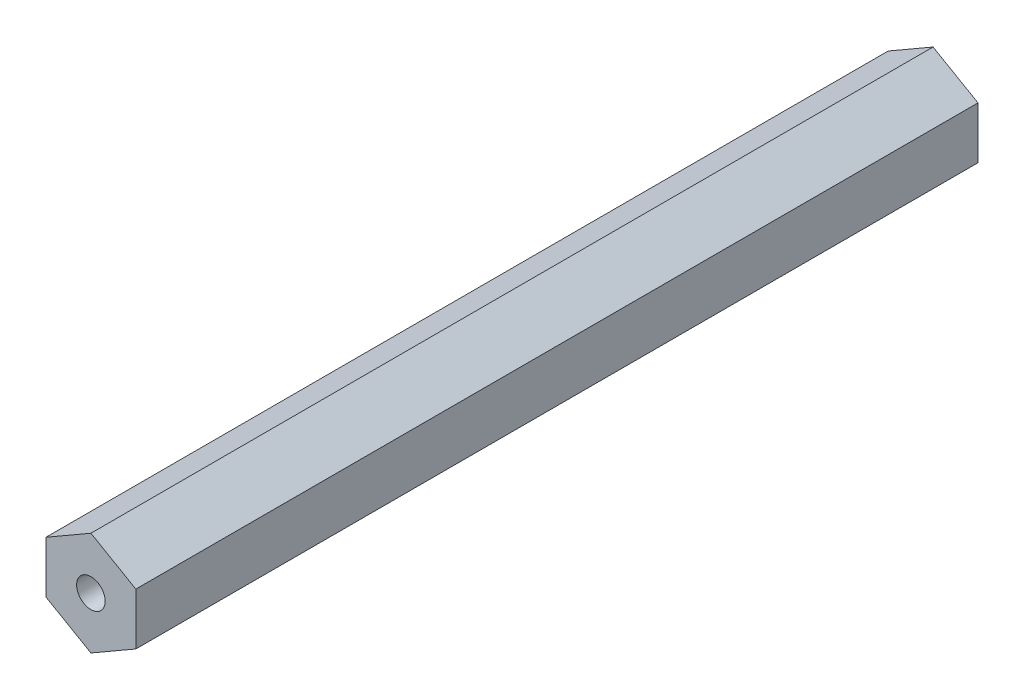
ISO-10303-21;
HEADER;
FILE_DESCRIPTION(('STEP AP214'),'2;1');
FILE_NAME('part.step','',(''),(''),'','','');
FILE_SCHEMA(('AUTOMOTIVE_DESIGN { 1 0 10303 214 1 1 1 1 }'));
ENDSEC;
DATA;
#1=APPLICATION_CONTEXT('core data for automotive mechanical design processes');
#2=APPLICATION_PROTOCOL_DEFINITION('international standard','automotive_design',2000,#1);
#3=PRODUCT_CONTEXT('',#1,'mechanical');
#4=PRODUCT('Part','Part','',(#3));
#5=PRODUCT_RELATED_PRODUCT_CATEGORY('part','',(#4));
#6=PRODUCT_DEFINITION_FORMATION('','',#4);
#7=PRODUCT_DEFINITION_CONTEXT('part definition',#1,'design');
#8=PRODUCT_DEFINITION('design','',#6,#7);
#9=PRODUCT_DEFINITION_SHAPE('','',#8);
#10=(LENGTH_UNIT() NAMED_UNIT(*) SI_UNIT(.MILLI.,.METRE.));
#11=(NAMED_UNIT(*) PLANE_ANGLE_UNIT() SI_UNIT($,.RADIAN.));
#12=(NAMED_UNIT(*) SI_UNIT($,.STERADIAN.) SOLID_ANGLE_UNIT());
#13=UNCERTAINTY_MEASURE_WITH_UNIT(LENGTH_MEASURE(1.E-05),#10,'distance_accuracy_value','');
#14=(GEOMETRIC_REPRESENTATION_CONTEXT(3) GLOBAL_UNCERTAINTY_ASSIGNED_CONTEXT((#13)) GLOBAL_UNIT_ASSIGNED_CONTEXT((#10,
#11,#12)) REPRESENTATION_CONTEXT('',''));
#15=CARTESIAN_POINT('',(0.,0.,0.));
#16=DIRECTION('',(0.,0.,1.));
#17=DIRECTION('',(1.,0.,0.));
#18=AXIS2_PLACEMENT_3D('',#15,#16,#17);
#19=CARTESIAN_POINT('',(6.35,3.66617420935412,119.0625));
#20=DIRECTION('',(-0.5,-0.866025403784439,0.));
#21=DIRECTION('',(0.866025403784439,-0.5,0.));
#22=AXIS2_PLACEMENT_3D('',#19,#20,#21);
#23=PLANE('',#22);
#24=DIRECTION('',(-0.866025403784439,0.5,0.));
#25=VECTOR('',#24,1.);
#26=CARTESIAN_POINT('',(6.35,3.66617420935412,0.));
#27=LINE('',#26,#25);
#28=CARTESIAN_POINT('',(6.35,3.66617420935412,0.));
#29=VERTEX_POINT('',#28);
#30=CARTESIAN_POINT('',(0.,7.33234841870825,0.));
#31=VERTEX_POINT('',#30);
#32=EDGE_CURVE('E137',#29,#31,#27,.T.);
#33=ORIENTED_EDGE('',*,*,#32,.T.);
#34=DIRECTION('',(0.,0.,-1.));
#35=VECTOR('',#34,1.);
#36=CARTESIAN_POINT('',(0.,7.33234841870825,119.0625));
#37=LINE('',#36,#35);
#38=CARTESIAN_POINT('',(0.,7.33234841870825,119.0625));
#39=VERTEX_POINT('',#38);
#40=EDGE_CURVE('E11',#39,#31,#37,.T.);
#41=ORIENTED_EDGE('',*,*,#40,.F.);
#42=DIRECTION('',(-0.866025403784439,0.5,0.));
#43=VECTOR('',#42,1.);
#44=CARTESIAN_POINT('',(6.35,3.66617420935412,119.0625));
#45=LINE('',#44,#43);
#46=CARTESIAN_POINT('',(6.35,3.66617420935412,119.0625));
#47=VERTEX_POINT('',#46);
#48=EDGE_CURVE('E154',#47,#39,#45,.T.);
#49=ORIENTED_EDGE('',*,*,#48,.F.);
#50=DIRECTION('',(0.,0.,-1.));
#51=VECTOR('',#50,1.);
#52=CARTESIAN_POINT('',(6.35,3.66617420935412,119.0625));
#53=LINE('',#52,#51);
#54=EDGE_CURVE('E133',#47,#29,#53,.T.);
#55=ORIENTED_EDGE('',*,*,#54,.T.);
#56=EDGE_LOOP('',(#33,#41,#49,#55));
#57=FACE_BOUND('',#56,.T.);
#58=ADVANCED_FACE('F44',(#57),#23,.F.);
#59=CARTESIAN_POINT('',(0.,7.33234841870825,119.0625));
#60=DIRECTION('',(0.5,-0.866025403784439,0.));
#61=DIRECTION('',(0.866025403784439,0.5,0.));
#62=AXIS2_PLACEMENT_3D('',#59,#60,#61);
#63=PLANE('',#62);
#64=DIRECTION('',(-0.866025403784439,-0.5,0.));
#65=VECTOR('',#64,1.);
#66=CARTESIAN_POINT('',(0.,7.33234841870825,0.));
#67=LINE('',#66,#65);
#68=CARTESIAN_POINT('',(-6.35,3.66617420935413,0.));
#69=VERTEX_POINT('',#68);
#70=EDGE_CURVE('E141',#31,#69,#67,.T.);
#71=ORIENTED_EDGE('',*,*,#70,.T.);
#72=DIRECTION('',(0.,0.,-1.));
#73=VECTOR('',#72,1.);
#74=CARTESIAN_POINT('',(-6.35,3.66617420935413,119.0625));
#75=LINE('',#74,#73);
#76=CARTESIAN_POINT('',(-6.35,3.66617420935413,119.0625));
#77=VERTEX_POINT('',#76);
#78=EDGE_CURVE('E53',#77,#69,#75,.T.);
#79=ORIENTED_EDGE('',*,*,#78,.F.);
#80=DIRECTION('',(-0.866025403784439,-0.5,0.));
#81=VECTOR('',#80,1.);
#82=CARTESIAN_POINT('',(0.,7.33234841870825,119.0625));
#83=LINE('',#82,#81);
#84=EDGE_CURVE('E99',#39,#77,#83,.T.);
#85=ORIENTED_EDGE('',*,*,#84,.F.);
#86=ORIENTED_EDGE('',*,*,#40,.T.);
#87=EDGE_LOOP('',(#71,#79,#85,#86));
#88=FACE_BOUND('',#87,.T.);
#89=ADVANCED_FACE('F184',(#88),#63,.F.);
#90=CARTESIAN_POINT('',(-6.35,3.66617420935413,119.0625));
#91=DIRECTION('',(1.,0.,0.));
#92=DIRECTION('',(0.,1.,0.));
#93=AXIS2_PLACEMENT_3D('',#90,#91,#92);
#94=PLANE('',#93);
#95=DIRECTION('',(0.,-1.,0.));
#96=VECTOR('',#95,1.);
#97=CARTESIAN_POINT('',(-6.35,3.66617420935413,0.));
#98=LINE('',#97,#96);
#99=CARTESIAN_POINT('',(-6.35,-3.66617420935412,0.));
#100=VERTEX_POINT('',#99);
#101=EDGE_CURVE('E145',#69,#100,#98,.T.);
#102=ORIENTED_EDGE('',*,*,#101,.T.);
#103=DIRECTION('',(0.,0.,-1.));
#104=VECTOR('',#103,1.);
#105=CARTESIAN_POINT('',(-6.35,-3.66617420935412,119.0625));
#106=LINE('',#105,#104);
#107=CARTESIAN_POINT('',(-6.35,-3.66617420935412,119.0625));
#108=VERTEX_POINT('',#107);
#109=EDGE_CURVE('E125',#108,#100,#106,.T.);
#110=ORIENTED_EDGE('',*,*,#109,.F.);
#111=DIRECTION('',(0.,-1.,0.));
#112=VECTOR('',#111,1.);
#113=CARTESIAN_POINT('',(-6.35,3.66617420935413,119.0625));
#114=LINE('',#113,#112);
#115=EDGE_CURVE('E114',#77,#108,#114,.T.);
#116=ORIENTED_EDGE('',*,*,#115,.F.);
#117=ORIENTED_EDGE('',*,*,#78,.T.);
#118=EDGE_LOOP('',(#102,#110,#116,#117));
#119=FACE_BOUND('',#118,.T.);
#120=ADVANCED_FACE('F165',(#119),#94,.F.);
#121=CARTESIAN_POINT('',(-6.35,-3.66617420935412,119.0625));
#122=DIRECTION('',(0.5,0.866025403784439,0.));
#123=DIRECTION('',(-0.866025403784439,0.5,0.));
#124=AXIS2_PLACEMENT_3D('',#121,#122,#123);
#125=PLANE('',#124);
#126=DIRECTION('',(0.866025403784438,-0.5,0.));
#127=VECTOR('',#126,1.);
#128=CARTESIAN_POINT('',(-6.35,-3.66617420935412,0.));
#129=LINE('',#128,#127);
#130=CARTESIAN_POINT('',(0.,-7.33234841870825,0.));
#131=VERTEX_POINT('',#130);
#132=EDGE_CURVE('E123',#100,#131,#129,.T.);
#133=ORIENTED_EDGE('',*,*,#132,.T.);
#134=DIRECTION('',(0.,0.,-1.));
#135=VECTOR('',#134,1.);
#136=CARTESIAN_POINT('',(0.,-7.33234841870825,119.0625));
#137=LINE('',#136,#135);
#138=CARTESIAN_POINT('',(0.,-7.33234841870825,119.0625));
#139=VERTEX_POINT('',#138);
#140=EDGE_CURVE('E120',#139,#131,#137,.T.);
#141=ORIENTED_EDGE('',*,*,#140,.F.);
#142=DIRECTION('',(0.866025403784438,-0.5,0.));
#143=VECTOR('',#142,1.);
#144=CARTESIAN_POINT('',(-6.35,-3.66617420935412,119.0625));
#145=LINE('',#144,#143);
#146=EDGE_CURVE('E108',#108,#139,#145,.T.);
#147=ORIENTED_EDGE('',*,*,#146,.F.);
#148=ORIENTED_EDGE('',*,*,#109,.T.);
#149=EDGE_LOOP('',(#133,#141,#147,#148));
#150=FACE_BOUND('',#149,.T.);
#151=ADVANCED_FACE('F121',(#150),#125,.F.);
#152=CARTESIAN_POINT('',(0.,-7.33234841870825,119.0625));
#153=DIRECTION('',(-0.5,0.866025403784439,0.));
#154=DIRECTION('',(-0.866025403784439,-0.5,0.));
#155=AXIS2_PLACEMENT_3D('',#152,#153,#154);
#156=PLANE('',#155);
#157=DIRECTION('',(0.866025403784439,0.5,0.));
#158=VECTOR('',#157,1.);
#159=CARTESIAN_POINT('',(0.,-7.33234841870825,0.));
#160=LINE('',#159,#158);
#161=CARTESIAN_POINT('',(6.35,-3.66617420935413,0.));
#162=VERTEX_POINT('',#161);
#163=EDGE_CURVE('E85',#131,#162,#160,.T.);
#164=ORIENTED_EDGE('',*,*,#163,.T.);
#165=DIRECTION('',(0.,0.,-1.));
#166=VECTOR('',#165,1.);
#167=CARTESIAN_POINT('',(6.35,-3.66617420935413,119.0625));
#168=LINE('',#167,#166);
#169=CARTESIAN_POINT('',(6.35,-3.66617420935413,119.0625));
#170=VERTEX_POINT('',#169);
#171=EDGE_CURVE('E126',#170,#162,#168,.T.);
#172=ORIENTED_EDGE('',*,*,#171,.F.);
#173=DIRECTION('',(0.866025403784439,0.5,0.));
#174=VECTOR('',#173,1.);
#175=CARTESIAN_POINT('',(0.,-7.33234841870825,119.0625));
#176=LINE('',#175,#174);
#177=EDGE_CURVE('E112',#139,#170,#176,.T.);
#178=ORIENTED_EDGE('',*,*,#177,.F.);
#179=ORIENTED_EDGE('',*,*,#140,.T.);
#180=EDGE_LOOP('',(#164,#172,#178,#179));
#181=FACE_BOUND('',#180,.T.);
#182=ADVANCED_FACE('F128',(#181),#156,.F.);
#183=CARTESIAN_POINT('',(6.35,-3.66617420935413,119.0625));
#184=DIRECTION('',(-1.,0.,0.));
#185=DIRECTION('',(0.,0.,1.));
#186=AXIS2_PLACEMENT_3D('',#183,#184,#185);
#187=PLANE('',#186);
#188=DIRECTION('',(0.,1.,0.));
#189=VECTOR('',#188,1.);
#190=CARTESIAN_POINT('',(6.35,-3.66617420935413,0.));
#191=LINE('',#190,#189);
#192=EDGE_CURVE('E91',#162,#29,#191,.T.);
#193=ORIENTED_EDGE('',*,*,#192,.T.);
#194=ORIENTED_EDGE('',*,*,#54,.F.);
#195=DIRECTION('',(0.,1.,0.));
#196=VECTOR('',#195,1.);
#197=CARTESIAN_POINT('',(6.35,-3.66617420935413,119.0625));
#198=LINE('',#197,#196);
#199=EDGE_CURVE('E61',#170,#47,#198,.T.);
#200=ORIENTED_EDGE('',*,*,#199,.F.);
#201=ORIENTED_EDGE('',*,*,#171,.T.);
#202=EDGE_LOOP('',(#193,#194,#200,#201));
#203=FACE_BOUND('',#202,.T.);
#204=ADVANCED_FACE('F172',(#203),#187,.F.);
#205=CARTESIAN_POINT('',(0.,0.,119.0625));
#206=DIRECTION('',(0.,0.,1.));
#207=DIRECTION('',(1.,0.,0.));
#208=AXIS2_PLACEMENT_3D('',#205,#206,#207);
#209=PLANE('',#208);
#210=CARTESIAN_POINT('',(0.,0.,119.0625));
#211=DIRECTION('',(0.,0.,1.));
#212=DIRECTION('',(1.,0.,0.));
#213=AXIS2_PLACEMENT_3D('',#210,#211,#212);
#214=CIRCLE('',#213,2.0193);
#215=CARTESIAN_POINT('',(2.0193,0.,119.0625));
#216=VERTEX_POINT('',#215);
#217=EDGE_CURVE('E337',#216,#216,#214,.T.);
#218=ORIENTED_EDGE('',*,*,#217,.F.);
#219=EDGE_LOOP('',(#218));
#220=FACE_BOUND('',#219,.T.);
#221=ORIENTED_EDGE('',*,*,#48,.T.);
#222=ORIENTED_EDGE('',*,*,#84,.T.);
#223=ORIENTED_EDGE('',*,*,#115,.T.);
#224=ORIENTED_EDGE('',*,*,#146,.T.);
#225=ORIENTED_EDGE('',*,*,#177,.T.);
#226=ORIENTED_EDGE('',*,*,#199,.T.);
#227=EDGE_LOOP('',(#221,#222,#223,#224,#225,#226));
#228=FACE_BOUND('',#227,.T.);
#229=ADVANCED_FACE('F110',(#220,#228),#209,.T.);
#230=CARTESIAN_POINT('',(0.,0.,0.));
#231=DIRECTION('',(0.,0.,1.));
#232=DIRECTION('',(1.,0.,0.));
#233=AXIS2_PLACEMENT_3D('',#230,#231,#232);
#234=PLANE('',#233);
#235=CARTESIAN_POINT('',(0.,0.,0.));
#236=DIRECTION('',(0.,0.,-1.));
#237=DIRECTION('',(-1.,0.,0.));
#238=AXIS2_PLACEMENT_3D('',#235,#236,#237);
#239=CIRCLE('',#238,2.5527);
#240=CARTESIAN_POINT('',(-2.5527,0.,0.));
#241=VERTEX_POINT('',#240);
#242=EDGE_CURVE('E342',#241,#241,#239,.T.);
#243=ORIENTED_EDGE('',*,*,#242,.F.);
#244=EDGE_LOOP('',(#243));
#245=FACE_BOUND('',#244,.T.);
#246=ORIENTED_EDGE('',*,*,#32,.F.);
#247=ORIENTED_EDGE('',*,*,#192,.F.);
#248=ORIENTED_EDGE('',*,*,#163,.F.);
#249=ORIENTED_EDGE('',*,*,#132,.F.);
#250=ORIENTED_EDGE('',*,*,#101,.F.);
#251=ORIENTED_EDGE('',*,*,#70,.F.);
#252=EDGE_LOOP('',(#246,#247,#248,#249,#250,#251));
#253=FACE_BOUND('',#252,.T.);
#254=ADVANCED_FACE('F168',(#245,#253),#234,.F.);
#255=CARTESIAN_POINT('',(0.,0.,16.51));
#256=DIRECTION('',(0.,0.,-1.));
#257=DIRECTION('',(-1.,0.,0.));
#258=AXIS2_PLACEMENT_3D('',#255,#256,#257);
#259=CONICAL_SURFACE('',#258,2.5527,1.02974425867665);
#260=CARTESIAN_POINT('',(0.,0.,18.0438169021917));
#261=VERTEX_POINT('',#260);
#262=VERTEX_LOOP('',#261);
#263=FACE_BOUND('',#262,.T.);
#264=CARTESIAN_POINT('',(0.,0.,16.51));
#265=DIRECTION('',(0.,0.,-1.));
#266=DIRECTION('',(-1.,0.,0.));
#267=AXIS2_PLACEMENT_3D('',#264,#265,#266);
#268=CIRCLE('',#267,2.5527);
#269=CARTESIAN_POINT('',(-2.5527,0.,16.51));
#270=VERTEX_POINT('',#269);
#271=EDGE_CURVE('E142',#270,#270,#268,.T.);
#272=ORIENTED_EDGE('',*,*,#271,.T.);
#273=EDGE_LOOP('',(#272));
#274=FACE_BOUND('',#273,.T.);
#275=ADVANCED_FACE('F223',(#263,#274),#259,.F.);
#276=CARTESIAN_POINT('',(0.,0.,0.));
#277=DIRECTION('',(0.,0.,-1.));
#278=DIRECTION('',(-1.,0.,0.));
#279=AXIS2_PLACEMENT_3D('',#276,#277,#278);
#280=CYLINDRICAL_SURFACE('',#279,2.5527);
#281=ORIENTED_EDGE('',*,*,#271,.F.);
#282=EDGE_LOOP('',(#281));
#283=FACE_BOUND('',#282,.T.);
#284=ORIENTED_EDGE('',*,*,#242,.T.);
#285=EDGE_LOOP('',(#284));
#286=FACE_BOUND('',#285,.T.);
#287=ADVANCED_FACE('F233',(#283,#286),#280,.F.);
#288=CARTESIAN_POINT('',(0.,0.,105.4481));
#289=DIRECTION('',(0.,0.,1.));
#290=DIRECTION('',(1.,0.,0.));
#291=AXIS2_PLACEMENT_3D('',#288,#289,#290);
#292=CONICAL_SURFACE('',#291,2.0193,1.02974425867665);
#293=CARTESIAN_POINT('',(0.,0.,104.234782151998));
#294=VERTEX_POINT('',#293);
#295=VERTEX_LOOP('',#294);
#296=FACE_BOUND('',#295,.T.);
#297=CARTESIAN_POINT('',(0.,0.,105.4481));
#298=DIRECTION('',(0.,0.,1.));
#299=DIRECTION('',(1.,0.,0.));
#300=AXIS2_PLACEMENT_3D('',#297,#298,#299);
#301=CIRCLE('',#300,2.0193);
#302=CARTESIAN_POINT('',(2.0193,0.,105.4481));
#303=VERTEX_POINT('',#302);
#304=EDGE_CURVE('E334',#303,#303,#301,.T.);
#305=ORIENTED_EDGE('',*,*,#304,.T.);
#306=EDGE_LOOP('',(#305));
#307=FACE_BOUND('',#306,.T.);
#308=ADVANCED_FACE('F245',(#296,#307),#292,.F.);
#309=CARTESIAN_POINT('',(0.,0.,119.0625));
#310=DIRECTION('',(0.,0.,1.));
#311=DIRECTION('',(1.,0.,0.));
#312=AXIS2_PLACEMENT_3D('',#309,#310,#311);
#313=CYLINDRICAL_SURFACE('',#312,2.0193);
#314=ORIENTED_EDGE('',*,*,#304,.F.);
#315=EDGE_LOOP('',(#314));
#316=FACE_BOUND('',#315,.T.);
#317=ORIENTED_EDGE('',*,*,#217,.T.);
#318=EDGE_LOOP('',(#317));
#319=FACE_BOUND('',#318,.T.);
#320=ADVANCED_FACE('F257',(#316,#319),#313,.F.);
#321=CLOSED_SHELL('',(#58,#89,#120,#151,#182,#204,#229,#254,#275,#287,#308,#320));
#322=MANIFOLD_SOLID_BREP('B2',#321);
#323=ADVANCED_BREP_SHAPE_REPRESENTATION('',(#18,#322),#14);
#324=SHAPE_DEFINITION_REPRESENTATION(#9,#323);
ENDSEC;
END-ISO-10303-21;
